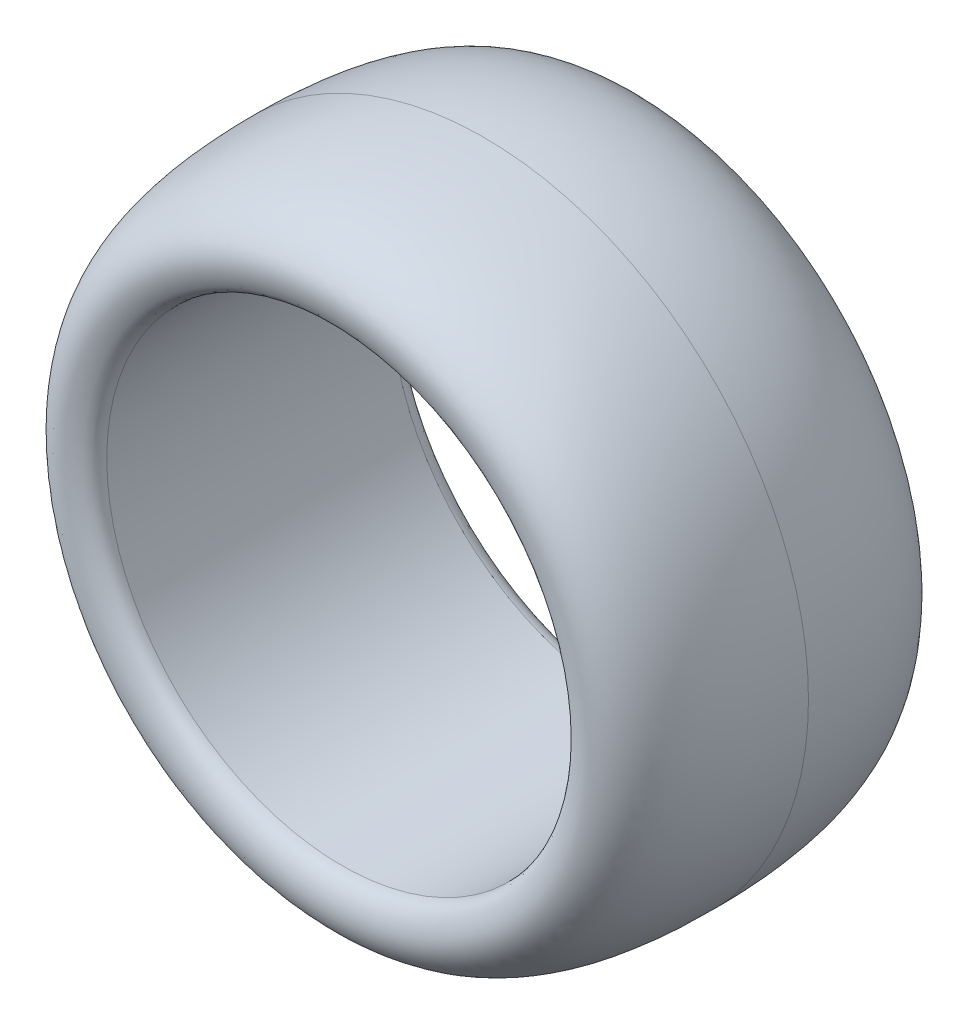
ISO-10303-21;
HEADER;
FILE_DESCRIPTION(('STEP AP214'),'2;1');
FILE_NAME('part.step','',(''),(''),'','','');
FILE_SCHEMA(('AUTOMOTIVE_DESIGN { 1 0 10303 214 1 1 1 1 }'));
ENDSEC;
DATA;
#1=APPLICATION_CONTEXT('core data for automotive mechanical design processes');
#2=APPLICATION_PROTOCOL_DEFINITION('international standard','automotive_design',2000,#1);
#3=PRODUCT_CONTEXT('',#1,'mechanical');
#4=PRODUCT('Part','Part','',(#3));
#5=PRODUCT_RELATED_PRODUCT_CATEGORY('part','',(#4));
#6=PRODUCT_DEFINITION_FORMATION('','',#4);
#7=PRODUCT_DEFINITION_CONTEXT('part definition',#1,'design');
#8=PRODUCT_DEFINITION('design','',#6,#7);
#9=PRODUCT_DEFINITION_SHAPE('','',#8);
#10=(LENGTH_UNIT() NAMED_UNIT(*) SI_UNIT(.MILLI.,.METRE.));
#11=(NAMED_UNIT(*) PLANE_ANGLE_UNIT() SI_UNIT($,.RADIAN.));
#12=(NAMED_UNIT(*) SI_UNIT($,.STERADIAN.) SOLID_ANGLE_UNIT());
#13=UNCERTAINTY_MEASURE_WITH_UNIT(LENGTH_MEASURE(1.E-05),#10,'distance_accuracy_value','');
#14=(GEOMETRIC_REPRESENTATION_CONTEXT(3) GLOBAL_UNCERTAINTY_ASSIGNED_CONTEXT((#13)) GLOBAL_UNIT_ASSIGNED_CONTEXT((#10,
#11,#12)) REPRESENTATION_CONTEXT('',''));
#15=CARTESIAN_POINT('',(0.,0.,0.));
#16=DIRECTION('',(0.,0.,1.));
#17=DIRECTION('',(1.,0.,0.));
#18=AXIS2_PLACEMENT_3D('',#15,#16,#17);
#19=CARTESIAN_POINT('',(0.,40.,-2.33227274137091E-13));
#20=CARTESIAN_POINT('',(0.,40.0211340977488,16.1975621112676));
#21=CARTESIAN_POINT('',(0.,34.4071721529852,20.3501461269127));
#22=CARTESIAN_POINT('',(0.,29.5068495136228,19.294580005527));
#23=CARTESIAN_POINT('',(0.,29.1062206884293,18.4262707827281));
#24=CARTESIAN_POINT('',(0.,29.,17.5));
#25=B_SPLINE_CURVE_WITH_KNOTS('',3,(#19,#20,#21,#22,#23,#24),.UNSPECIFIED.,.F.,.F.,(4,1,1,4),
(0.,0.468522945763174,0.568522945763174,1.),.UNSPECIFIED.);
#26=CARTESIAN_POINT('',(0.,0.,0.));
#27=DIRECTION('',(0.,0.,1.));
#28=AXIS1_PLACEMENT('',#26,#27);
#29=SURFACE_OF_REVOLUTION('',#25,#28);
#30=CARTESIAN_POINT('',(0.,0.,17.5));
#31=DIRECTION('',(0.,0.,1.));
#32=DIRECTION('',(1.,0.,0.));
#33=AXIS2_PLACEMENT_3D('',#30,#31,#32);
#34=CIRCLE('',#33,29.);
#35=CARTESIAN_POINT('',(29.,0.,17.5));
#36=VERTEX_POINT('',#35);
#37=EDGE_CURVE('E12',#36,#36,#34,.T.);
#38=ORIENTED_EDGE('',*,*,#37,.F.);
#39=EDGE_LOOP('',(#38));
#40=FACE_BOUND('',#39,.T.);
#41=CARTESIAN_POINT('',(0.,0.,2.33227274137091E-13));
#42=DIRECTION('',(0.,0.,1.));
#43=DIRECTION('',(1.,0.,0.));
#44=AXIS2_PLACEMENT_3D('',#41,#42,#43);
#45=CIRCLE('',#44,40.);
#46=CARTESIAN_POINT('',(40.,0.,2.33227274137091E-13));
#47=VERTEX_POINT('',#46);
#48=EDGE_CURVE('E54',#47,#47,#45,.T.);
#49=ORIENTED_EDGE('',*,*,#48,.T.);
#50=EDGE_LOOP('',(#49));
#51=FACE_BOUND('',#50,.T.);
#52=ADVANCED_FACE('F43',(#40,#51),#29,.T.);
#53=CARTESIAN_POINT('',(0.,0.,0.));
#54=DIRECTION('',(0.,0.,1.));
#55=DIRECTION('',(1.,0.,0.));
#56=AXIS2_PLACEMENT_3D('',#53,#54,#55);
#57=CYLINDRICAL_SURFACE('',#56,29.);
#58=CARTESIAN_POINT('',(0.,0.,-17.5));
#59=DIRECTION('',(0.,0.,1.));
#60=DIRECTION('',(1.,0.,0.));
#61=AXIS2_PLACEMENT_3D('',#58,#59,#60);
#62=CIRCLE('',#61,29.);
#63=CARTESIAN_POINT('',(29.,0.,-17.5));
#64=VERTEX_POINT('',#63);
#65=EDGE_CURVE('E50',#64,#64,#62,.T.);
#66=ORIENTED_EDGE('',*,*,#65,.F.);
#67=EDGE_LOOP('',(#66));
#68=FACE_BOUND('',#67,.T.);
#69=ORIENTED_EDGE('',*,*,#37,.T.);
#70=EDGE_LOOP('',(#69));
#71=FACE_BOUND('',#70,.T.);
#72=ADVANCED_FACE('F72',(#68,#71),#57,.F.);
#73=CARTESIAN_POINT('',(0.,29.,-17.5));
#74=CARTESIAN_POINT('',(0.,29.1062206884293,-18.4262707827281));
#75=CARTESIAN_POINT('',(0.,29.5068495136228,-19.294580005527));
#76=CARTESIAN_POINT('',(0.,34.4071721529852,-20.3501461269127));
#77=CARTESIAN_POINT('',(0.,40.0211340977488,-16.1975621112676));
#78=CARTESIAN_POINT('',(0.,40.,2.33227274137091E-13));
#79=B_SPLINE_CURVE_WITH_KNOTS('',3,(#73,#74,#75,#76,#77,#78),.UNSPECIFIED.,.F.,.F.,(4,1,1,4),
(0.,0.431477054236826,0.531477054236826,1.),.UNSPECIFIED.);
#80=CARTESIAN_POINT('',(0.,0.,0.));
#81=DIRECTION('',(0.,0.,1.));
#82=AXIS1_PLACEMENT('',#80,#81);
#83=SURFACE_OF_REVOLUTION('',#79,#82);
#84=ORIENTED_EDGE('',*,*,#48,.F.);
#85=EDGE_LOOP('',(#84));
#86=FACE_BOUND('',#85,.T.);
#87=ORIENTED_EDGE('',*,*,#65,.T.);
#88=EDGE_LOOP('',(#87));
#89=FACE_BOUND('',#88,.T.);
#90=ADVANCED_FACE('F70',(#86,#89),#83,.T.);
#91=CLOSED_SHELL('',(#52,#72,#90));
#92=MANIFOLD_SOLID_BREP('B2',#91);
#93=ADVANCED_BREP_SHAPE_REPRESENTATION('',(#18,#92),#14);
#94=SHAPE_DEFINITION_REPRESENTATION(#9,#93);
ENDSEC;
END-ISO-10303-21;
